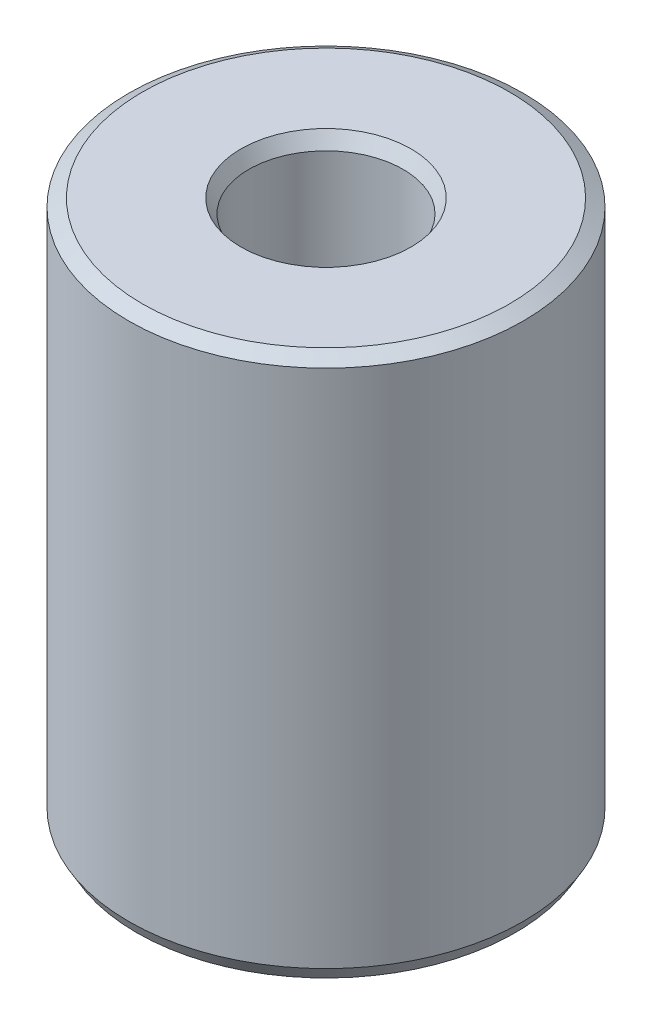
ISO-10303-21;
HEADER;
FILE_DESCRIPTION(('STEP AP214'),'2;1');
FILE_NAME('part.step','',(''),(''),'','','');
FILE_SCHEMA(('AUTOMOTIVE_DESIGN { 1 0 10303 214 1 1 1 1 }'));
ENDSEC;
DATA;
#1=APPLICATION_CONTEXT('core data for automotive mechanical design processes');
#2=APPLICATION_PROTOCOL_DEFINITION('international standard','automotive_design',2000,#1);
#3=PRODUCT_CONTEXT('',#1,'mechanical');
#4=PRODUCT('Part','Part','',(#3));
#5=PRODUCT_RELATED_PRODUCT_CATEGORY('part','',(#4));
#6=PRODUCT_DEFINITION_FORMATION('','',#4);
#7=PRODUCT_DEFINITION_CONTEXT('part definition',#1,'design');
#8=PRODUCT_DEFINITION('design','',#6,#7);
#9=PRODUCT_DEFINITION_SHAPE('','',#8);
#10=(LENGTH_UNIT() NAMED_UNIT(*) SI_UNIT(.MILLI.,.METRE.));
#11=(NAMED_UNIT(*) PLANE_ANGLE_UNIT() SI_UNIT($,.RADIAN.));
#12=(NAMED_UNIT(*) SI_UNIT($,.STERADIAN.) SOLID_ANGLE_UNIT());
#13=UNCERTAINTY_MEASURE_WITH_UNIT(LENGTH_MEASURE(1.E-05),#10,'distance_accuracy_value','');
#14=(GEOMETRIC_REPRESENTATION_CONTEXT(3) GLOBAL_UNCERTAINTY_ASSIGNED_CONTEXT((#13)) GLOBAL_UNIT_ASSIGNED_CONTEXT((#10,
#11,#12)) REPRESENTATION_CONTEXT('',''));
#15=CARTESIAN_POINT('',(0.,0.,0.));
#16=DIRECTION('',(0.,0.,1.));
#17=DIRECTION('',(1.,0.,0.));
#18=AXIS2_PLACEMENT_3D('',#15,#16,#17);
#19=CARTESIAN_POINT('',(0.,41.1822243649299,0.));
#20=DIRECTION('',(0.,-1.,0.));
#21=DIRECTION('',(0.,0.,-1.));
#22=AXIS2_PLACEMENT_3D('',#19,#20,#21);
#23=CYLINDRICAL_SURFACE('',#22,15.);
#24=CARTESIAN_POINT('',(0.,1.0451160798895,0.));
#25=DIRECTION('',(0.,1.,0.));
#26=DIRECTION('',(0.,0.,1.));
#27=AXIS2_PLACEMENT_3D('',#24,#25,#26);
#28=CIRCLE('',#27,15.);
#29=CARTESIAN_POINT('',(0.,1.0451160798895,15.));
#30=VERTEX_POINT('',#29);
#31=EDGE_CURVE('E10',#30,#30,#28,.T.);
#32=ORIENTED_EDGE('',*,*,#31,.T.);
#33=EDGE_LOOP('',(#32));
#34=FACE_BOUND('',#33,.T.);
#35=CARTESIAN_POINT('',(0.,40.5788263148713,0.));
#36=DIRECTION('',(0.,1.,0.));
#37=DIRECTION('',(0.,0.,1.));
#38=AXIS2_PLACEMENT_3D('',#35,#36,#37);
#39=CIRCLE('',#38,15.);
#40=CARTESIAN_POINT('',(0.,40.5788263148713,15.));
#41=VERTEX_POINT('',#40);
#42=EDGE_CURVE('E50',#41,#41,#39,.F.);
#43=ORIENTED_EDGE('',*,*,#42,.T.);
#44=EDGE_LOOP('',(#43));
#45=FACE_BOUND('',#44,.T.);
#46=ADVANCED_FACE('F39',(#34,#45),#23,.T.);
#47=CARTESIAN_POINT('',(0.,41.1822243649299,0.));
#48=DIRECTION('',(0.,1.,0.));
#49=DIRECTION('',(0.,0.,1.));
#50=AXIS2_PLACEMENT_3D('',#47,#48,#49);
#51=PLANE('',#50);
#52=CARTESIAN_POINT('',(0.,41.1822243649299,0.));
#53=DIRECTION('',(0.,1.,0.));
#54=DIRECTION('',(0.,0.,1.));
#55=AXIS2_PLACEMENT_3D('',#52,#53,#54);
#56=CIRCLE('',#55,6.4672252937504);
#57=CARTESIAN_POINT('',(0.,41.1822243649299,6.4672252937504));
#58=VERTEX_POINT('',#57);
#59=EDGE_CURVE('E58',#58,#58,#56,.F.);
#60=ORIENTED_EDGE('',*,*,#59,.T.);
#61=EDGE_LOOP('',(#60));
#62=FACE_BOUND('',#61,.T.);
#63=CARTESIAN_POINT('',(0.,41.1822243649299,0.));
#64=DIRECTION('',(0.,1.,0.));
#65=DIRECTION('',(0.,0.,1.));
#66=AXIS2_PLACEMENT_3D('',#63,#64,#65);
#67=CIRCLE('',#66,13.9548839201105);
#68=CARTESIAN_POINT('',(0.,41.1822243649299,13.9548839201105));
#69=VERTEX_POINT('',#68);
#70=EDGE_CURVE('E61',#69,#69,#67,.T.);
#71=ORIENTED_EDGE('',*,*,#70,.T.);
#72=EDGE_LOOP('',(#71));
#73=FACE_BOUND('',#72,.T.);
#74=ADVANCED_FACE('F88',(#62,#73),#51,.T.);
#75=CARTESIAN_POINT('',(0.,0.,0.));
#76=DIRECTION('',(0.,1.,0.));
#77=DIRECTION('',(0.,0.,1.));
#78=AXIS2_PLACEMENT_3D('',#75,#76,#77);
#79=PLANE('',#78);
#80=CARTESIAN_POINT('',(0.,0.,0.));
#81=DIRECTION('',(0.,1.,0.));
#82=DIRECTION('',(0.,0.,1.));
#83=AXIS2_PLACEMENT_3D('',#80,#81,#82);
#84=CIRCLE('',#83,6.90894332358129);
#85=CARTESIAN_POINT('',(0.,0.,6.90894332358129));
#86=VERTEX_POINT('',#85);
#87=EDGE_CURVE('E51',#86,#86,#84,.T.);
#88=ORIENTED_EDGE('',*,*,#87,.T.);
#89=EDGE_LOOP('',(#88));
#90=FACE_BOUND('',#89,.T.);
#91=CARTESIAN_POINT('',(0.,0.,0.));
#92=DIRECTION('',(0.,1.,0.));
#93=DIRECTION('',(0.,0.,1.));
#94=AXIS2_PLACEMENT_3D('',#91,#92,#93);
#95=CIRCLE('',#94,14.3966019499414);
#96=CARTESIAN_POINT('',(0.,0.,14.3966019499414));
#97=VERTEX_POINT('',#96);
#98=EDGE_CURVE('E54',#97,#97,#95,.F.);
#99=ORIENTED_EDGE('',*,*,#98,.T.);
#100=EDGE_LOOP('',(#99));
#101=FACE_BOUND('',#100,.T.);
#102=ADVANCED_FACE('F83',(#90,#101),#79,.F.);
#103=CARTESIAN_POINT('',(0.,41.1822243649299,0.));
#104=DIRECTION('',(0.,-1.,0.));
#105=DIRECTION('',(0.,0.,-1.));
#106=AXIS2_PLACEMENT_3D('',#103,#104,#105);
#107=CYLINDRICAL_SURFACE('',#106,5.86382724369178);
#108=CARTESIAN_POINT('',(0.,40.1371082850404,0.));
#109=DIRECTION('',(0.,1.,0.));
#110=DIRECTION('',(0.,0.,1.));
#111=AXIS2_PLACEMENT_3D('',#108,#109,#110);
#112=CIRCLE('',#111,5.86382724369178);
#113=CARTESIAN_POINT('',(0.,40.1371082850404,5.86382724369178));
#114=VERTEX_POINT('',#113);
#115=EDGE_CURVE('E67',#114,#114,#112,.T.);
#116=ORIENTED_EDGE('',*,*,#115,.T.);
#117=EDGE_LOOP('',(#116));
#118=FACE_BOUND('',#117,.T.);
#119=CARTESIAN_POINT('',(0.,0.603398050058622,0.));
#120=DIRECTION('',(0.,1.,0.));
#121=DIRECTION('',(0.,0.,1.));
#122=AXIS2_PLACEMENT_3D('',#119,#120,#121);
#123=CIRCLE('',#122,5.86382724369178);
#124=CARTESIAN_POINT('',(0.,0.603398050058622,5.86382724369178));
#125=VERTEX_POINT('',#124);
#126=EDGE_CURVE('E69',#125,#125,#123,.F.);
#127=ORIENTED_EDGE('',*,*,#126,.T.);
#128=EDGE_LOOP('',(#127));
#129=FACE_BOUND('',#128,.T.);
#130=ADVANCED_FACE('F71',(#118,#129),#107,.F.);
#131=CARTESIAN_POINT('',(0.,40.1371082850404,0.));
#132=DIRECTION('',(0.,1.,0.));
#133=DIRECTION('',(0.,0.,1.));
#134=AXIS2_PLACEMENT_3D('',#131,#132,#133);
#135=CONICAL_SURFACE('',#134,5.86382724369178,0.523598775598296);
#136=ORIENTED_EDGE('',*,*,#59,.F.);
#137=EDGE_LOOP('',(#136));
#138=FACE_BOUND('',#137,.T.);
#139=ORIENTED_EDGE('',*,*,#115,.F.);
#140=EDGE_LOOP('',(#139));
#141=FACE_BOUND('',#140,.T.);
#142=ADVANCED_FACE('F77',(#138,#141),#135,.F.);
#143=CARTESIAN_POINT('',(0.,0.,0.));
#144=DIRECTION('',(0.,-1.,0.));
#145=DIRECTION('',(0.,0.,-1.));
#146=AXIS2_PLACEMENT_3D('',#143,#144,#145);
#147=CONICAL_SURFACE('',#146,6.90894332358129,1.0471975511966);
#148=ORIENTED_EDGE('',*,*,#126,.F.);
#149=EDGE_LOOP('',(#148));
#150=FACE_BOUND('',#149,.T.);
#151=ORIENTED_EDGE('',*,*,#87,.F.);
#152=EDGE_LOOP('',(#151));
#153=FACE_BOUND('',#152,.T.);
#154=ADVANCED_FACE('F73',(#150,#153),#147,.F.);
#155=CARTESIAN_POINT('',(0.,1.0451160798895,0.));
#156=DIRECTION('',(0.,1.,0.));
#157=DIRECTION('',(0.,0.,1.));
#158=AXIS2_PLACEMENT_3D('',#155,#156,#157);
#159=CONICAL_SURFACE('',#158,15.,0.5235987755983);
#160=ORIENTED_EDGE('',*,*,#98,.F.);
#161=EDGE_LOOP('',(#160));
#162=FACE_BOUND('',#161,.T.);
#163=ORIENTED_EDGE('',*,*,#31,.F.);
#164=EDGE_LOOP('',(#163));
#165=FACE_BOUND('',#164,.T.);
#166=ADVANCED_FACE('F76',(#162,#165),#159,.T.);
#167=CARTESIAN_POINT('',(0.,41.1822243649299,0.));
#168=DIRECTION('',(0.,-1.,0.));
#169=DIRECTION('',(0.,0.,-1.));
#170=AXIS2_PLACEMENT_3D('',#167,#168,#169);
#171=CONICAL_SURFACE('',#170,13.9548839201105,1.0471975511966);
#172=ORIENTED_EDGE('',*,*,#42,.F.);
#173=EDGE_LOOP('',(#172));
#174=FACE_BOUND('',#173,.T.);
#175=ORIENTED_EDGE('',*,*,#70,.F.);
#176=EDGE_LOOP('',(#175));
#177=FACE_BOUND('',#176,.T.);
#178=ADVANCED_FACE('F45',(#174,#177),#171,.T.);
#179=CLOSED_SHELL('',(#46,#74,#102,#130,#142,#154,#166,#178));
#180=MANIFOLD_SOLID_BREP('B2',#179);
#181=ADVANCED_BREP_SHAPE_REPRESENTATION('',(#18,#180),#14);
#182=SHAPE_DEFINITION_REPRESENTATION(#9,#181);
ENDSEC;
END-ISO-10303-21;
